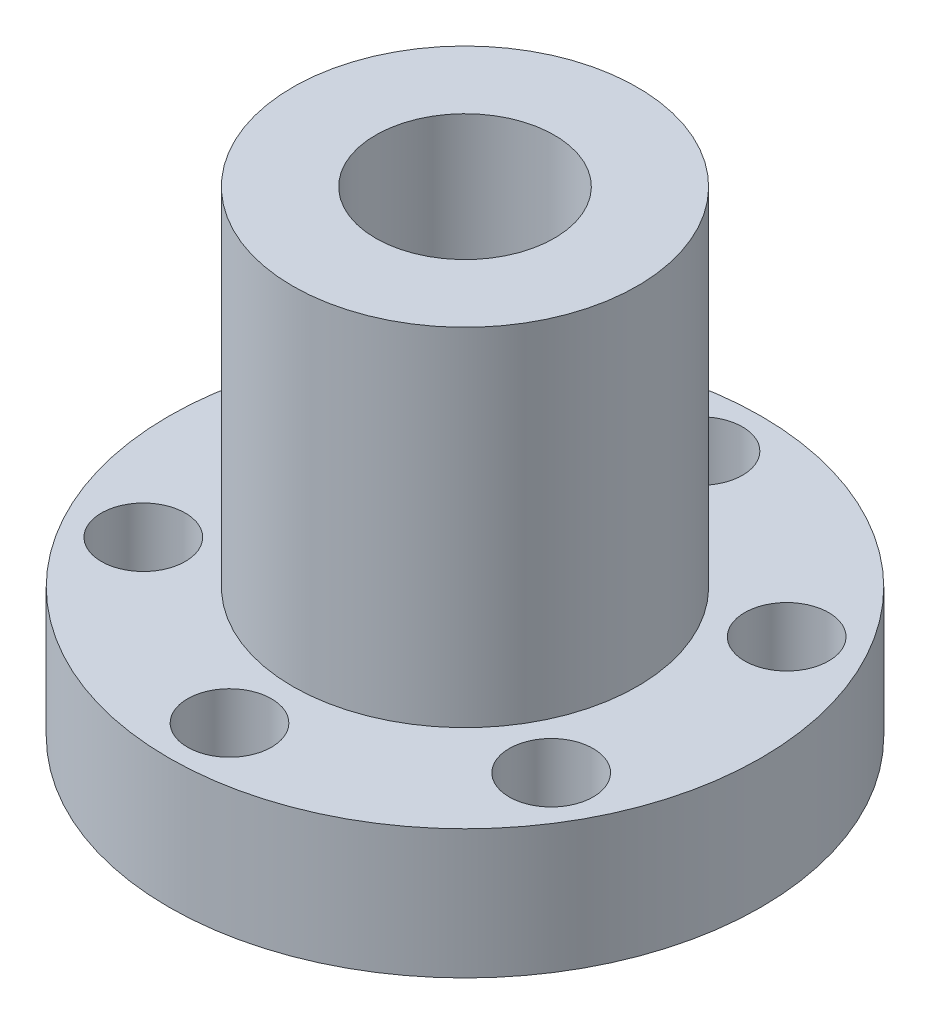
ISO-10303-21;
HEADER;
FILE_DESCRIPTION(('STEP AP214'),'2;1');
FILE_NAME('part.step','',(''),(''),'','','');
FILE_SCHEMA(('AUTOMOTIVE_DESIGN { 1 0 10303 214 1 1 1 1 }'));
ENDSEC;
DATA;
#1=APPLICATION_CONTEXT('core data for automotive mechanical design processes');
#2=APPLICATION_PROTOCOL_DEFINITION('international standard','automotive_design',2000,#1);
#3=PRODUCT_CONTEXT('',#1,'mechanical');
#4=PRODUCT('Part','Part','',(#3));
#5=PRODUCT_RELATED_PRODUCT_CATEGORY('part','',(#4));
#6=PRODUCT_DEFINITION_FORMATION('','',#4);
#7=PRODUCT_DEFINITION_CONTEXT('part definition',#1,'design');
#8=PRODUCT_DEFINITION('design','',#6,#7);
#9=PRODUCT_DEFINITION_SHAPE('','',#8);
#10=(LENGTH_UNIT() NAMED_UNIT(*) SI_UNIT(.MILLI.,.METRE.));
#11=(NAMED_UNIT(*) PLANE_ANGLE_UNIT() SI_UNIT($,.RADIAN.));
#12=(NAMED_UNIT(*) SI_UNIT($,.STERADIAN.) SOLID_ANGLE_UNIT());
#13=UNCERTAINTY_MEASURE_WITH_UNIT(LENGTH_MEASURE(1.E-05),#10,'distance_accuracy_value','');
#14=(GEOMETRIC_REPRESENTATION_CONTEXT(3) GLOBAL_UNCERTAINTY_ASSIGNED_CONTEXT((#13)) GLOBAL_UNIT_ASSIGNED_CONTEXT((#10,
#11,#12)) REPRESENTATION_CONTEXT('',''));
#15=CARTESIAN_POINT('',(0.,0.,0.));
#16=DIRECTION('',(0.,0.,1.));
#17=DIRECTION('',(1.,0.,0.));
#18=AXIS2_PLACEMENT_3D('',#15,#16,#17);
#19=CARTESIAN_POINT('',(0.,12.,0.));
#20=DIRECTION('',(0.,1.,0.));
#21=DIRECTION('',(0.,0.,1.));
#22=AXIS2_PLACEMENT_3D('',#19,#20,#21);
#23=PLANE('',#22);
#24=CARTESIAN_POINT('',(18.9399488772411,12.,10.9349845827129));
#25=DIRECTION('',(0.,1.,0.));
#26=DIRECTION('',(0.,0.,1.));
#27=AXIS2_PLACEMENT_3D('',#24,#25,#26);
#28=CIRCLE('',#27,3.9);
#29=CARTESIAN_POINT('',(18.9399488772411,12.,14.8349845827129));
#30=VERTEX_POINT('',#29);
#31=EDGE_CURVE('E52',#30,#30,#28,.F.);
#32=ORIENTED_EDGE('',*,*,#31,.T.);
#33=EDGE_LOOP('',(#32));
#34=FACE_BOUND('',#33,.T.);
#35=CARTESIAN_POINT('',(18.9399488772411,12.,-10.9349845827129));
#36=DIRECTION('',(0.,1.,0.));
#37=DIRECTION('',(0.,0.,1.));
#38=AXIS2_PLACEMENT_3D('',#35,#36,#37);
#39=CIRCLE('',#38,3.9);
#40=CARTESIAN_POINT('',(18.9399488772411,12.,-7.03498458271292));
#41=VERTEX_POINT('',#40);
#42=EDGE_CURVE('E55',#41,#41,#39,.F.);
#43=ORIENTED_EDGE('',*,*,#42,.T.);
#44=EDGE_LOOP('',(#43));
#45=FACE_BOUND('',#44,.T.);
#46=CARTESIAN_POINT('',(0.,12.,-21.8699691654258));
#47=DIRECTION('',(0.,1.,0.));
#48=DIRECTION('',(0.,0.,1.));
#49=AXIS2_PLACEMENT_3D('',#46,#47,#48);
#50=CIRCLE('',#49,3.9);
#51=CARTESIAN_POINT('',(0.,12.,-17.9699691654258));
#52=VERTEX_POINT('',#51);
#53=EDGE_CURVE('E58',#52,#52,#50,.F.);
#54=ORIENTED_EDGE('',*,*,#53,.T.);
#55=EDGE_LOOP('',(#54));
#56=FACE_BOUND('',#55,.T.);
#57=CARTESIAN_POINT('',(-18.9399488772411,12.,-10.9349845827129));
#58=DIRECTION('',(0.,1.,0.));
#59=DIRECTION('',(0.,0.,1.));
#60=AXIS2_PLACEMENT_3D('',#57,#58,#59);
#61=CIRCLE('',#60,3.9);
#62=CARTESIAN_POINT('',(-18.9399488772411,12.,-7.03498458271291));
#63=VERTEX_POINT('',#62);
#64=EDGE_CURVE('E61',#63,#63,#61,.F.);
#65=ORIENTED_EDGE('',*,*,#64,.T.);
#66=EDGE_LOOP('',(#65));
#67=FACE_BOUND('',#66,.T.);
#68=CARTESIAN_POINT('',(-18.9399488772411,12.,10.9349845827129));
#69=DIRECTION('',(0.,1.,0.));
#70=DIRECTION('',(0.,0.,1.));
#71=AXIS2_PLACEMENT_3D('',#68,#69,#70);
#72=CIRCLE('',#71,3.9);
#73=CARTESIAN_POINT('',(-18.9399488772411,12.,14.8349845827129));
#74=VERTEX_POINT('',#73);
#75=EDGE_CURVE('E64',#74,#74,#72,.F.);
#76=ORIENTED_EDGE('',*,*,#75,.T.);
#77=EDGE_LOOP('',(#76));
#78=FACE_BOUND('',#77,.T.);
#79=CARTESIAN_POINT('',(0.,12.,21.8699691654258));
#80=DIRECTION('',(0.,1.,0.));
#81=DIRECTION('',(0.,0.,1.));
#82=AXIS2_PLACEMENT_3D('',#79,#80,#81);
#83=CIRCLE('',#82,3.9);
#84=CARTESIAN_POINT('',(0.,12.,25.7699691654258));
#85=VERTEX_POINT('',#84);
#86=EDGE_CURVE('E67',#85,#85,#83,.F.);
#87=ORIENTED_EDGE('',*,*,#86,.T.);
#88=EDGE_LOOP('',(#87));
#89=FACE_BOUND('',#88,.T.);
#90=CARTESIAN_POINT('',(0.,12.,0.));
#91=DIRECTION('',(0.,1.,0.));
#92=DIRECTION('',(0.,0.,1.));
#93=AXIS2_PLACEMENT_3D('',#90,#91,#92);
#94=CIRCLE('',#93,27.5);
#95=CARTESIAN_POINT('',(0.,12.,27.5));
#96=VERTEX_POINT('',#95);
#97=EDGE_CURVE('E10',#96,#96,#94,.T.);
#98=ORIENTED_EDGE('',*,*,#97,.T.);
#99=EDGE_LOOP('',(#98));
#100=FACE_BOUND('',#99,.T.);
#101=CARTESIAN_POINT('',(0.,12.,0.));
#102=DIRECTION('',(0.,1.,0.));
#103=DIRECTION('',(0.,0.,1.));
#104=AXIS2_PLACEMENT_3D('',#101,#102,#103);
#105=CIRCLE('',#104,16.);
#106=CARTESIAN_POINT('',(0.,12.,16.));
#107=VERTEX_POINT('',#106);
#108=EDGE_CURVE('E45',#107,#107,#105,.T.);
#109=ORIENTED_EDGE('',*,*,#108,.F.);
#110=EDGE_LOOP('',(#109));
#111=FACE_BOUND('',#110,.T.);
#112=ADVANCED_FACE('F34',(#34,#45,#56,#67,#78,#89,#100,#111),#23,.T.);
#113=CARTESIAN_POINT('',(0.,0.,0.));
#114=DIRECTION('',(0.,1.,0.));
#115=DIRECTION('',(0.,0.,1.));
#116=AXIS2_PLACEMENT_3D('',#113,#114,#115);
#117=PLANE('',#116);
#118=CARTESIAN_POINT('',(18.9399488772411,0.,10.9349845827129));
#119=DIRECTION('',(0.,1.,0.));
#120=DIRECTION('',(0.,0.,1.));
#121=AXIS2_PLACEMENT_3D('',#118,#119,#120);
#122=CIRCLE('',#121,3.9);
#123=CARTESIAN_POINT('',(18.9399488772411,0.,14.8349845827129));
#124=VERTEX_POINT('',#123);
#125=EDGE_CURVE('E77',#124,#124,#122,.T.);
#126=ORIENTED_EDGE('',*,*,#125,.T.);
#127=EDGE_LOOP('',(#126));
#128=FACE_BOUND('',#127,.T.);
#129=CARTESIAN_POINT('',(18.9399488772411,0.,-10.9349845827129));
#130=DIRECTION('',(0.,1.,0.));
#131=DIRECTION('',(0.,0.,1.));
#132=AXIS2_PLACEMENT_3D('',#129,#130,#131);
#133=CIRCLE('',#132,3.9);
#134=CARTESIAN_POINT('',(18.9399488772411,0.,-7.03498458271292));
#135=VERTEX_POINT('',#134);
#136=EDGE_CURVE('E80',#135,#135,#133,.T.);
#137=ORIENTED_EDGE('',*,*,#136,.T.);
#138=EDGE_LOOP('',(#137));
#139=FACE_BOUND('',#138,.T.);
#140=CARTESIAN_POINT('',(0.,0.,-21.8699691654258));
#141=DIRECTION('',(0.,1.,0.));
#142=DIRECTION('',(0.,0.,1.));
#143=AXIS2_PLACEMENT_3D('',#140,#141,#142);
#144=CIRCLE('',#143,3.9);
#145=CARTESIAN_POINT('',(0.,0.,-17.9699691654258));
#146=VERTEX_POINT('',#145);
#147=EDGE_CURVE('E83',#146,#146,#144,.T.);
#148=ORIENTED_EDGE('',*,*,#147,.T.);
#149=EDGE_LOOP('',(#148));
#150=FACE_BOUND('',#149,.T.);
#151=CARTESIAN_POINT('',(-18.9399488772411,0.,-10.9349845827129));
#152=DIRECTION('',(0.,1.,0.));
#153=DIRECTION('',(0.,0.,1.));
#154=AXIS2_PLACEMENT_3D('',#151,#152,#153);
#155=CIRCLE('',#154,3.9);
#156=CARTESIAN_POINT('',(-18.9399488772411,0.,-7.03498458271291));
#157=VERTEX_POINT('',#156);
#158=EDGE_CURVE('E86',#157,#157,#155,.T.);
#159=ORIENTED_EDGE('',*,*,#158,.T.);
#160=EDGE_LOOP('',(#159));
#161=FACE_BOUND('',#160,.T.);
#162=CARTESIAN_POINT('',(-18.9399488772411,0.,10.9349845827129));
#163=DIRECTION('',(0.,1.,0.));
#164=DIRECTION('',(0.,0.,1.));
#165=AXIS2_PLACEMENT_3D('',#162,#163,#164);
#166=CIRCLE('',#165,3.9);
#167=CARTESIAN_POINT('',(-18.9399488772411,0.,14.8349845827129));
#168=VERTEX_POINT('',#167);
#169=EDGE_CURVE('E89',#168,#168,#166,.T.);
#170=ORIENTED_EDGE('',*,*,#169,.T.);
#171=EDGE_LOOP('',(#170));
#172=FACE_BOUND('',#171,.T.);
#173=CARTESIAN_POINT('',(0.,0.,21.8699691654258));
#174=DIRECTION('',(0.,1.,0.));
#175=DIRECTION('',(0.,0.,1.));
#176=AXIS2_PLACEMENT_3D('',#173,#174,#175);
#177=CIRCLE('',#176,3.9);
#178=CARTESIAN_POINT('',(0.,0.,25.7699691654258));
#179=VERTEX_POINT('',#178);
#180=EDGE_CURVE('E74',#179,#179,#177,.T.);
#181=ORIENTED_EDGE('',*,*,#180,.T.);
#182=EDGE_LOOP('',(#181));
#183=FACE_BOUND('',#182,.T.);
#184=CARTESIAN_POINT('',(0.,0.,0.));
#185=DIRECTION('',(0.,1.,0.));
#186=DIRECTION('',(0.,0.,1.));
#187=AXIS2_PLACEMENT_3D('',#184,#185,#186);
#188=CIRCLE('',#187,8.3);
#189=CARTESIAN_POINT('',(0.,0.,8.3));
#190=VERTEX_POINT('',#189);
#191=EDGE_CURVE('E71',#190,#190,#188,.T.);
#192=ORIENTED_EDGE('',*,*,#191,.T.);
#193=EDGE_LOOP('',(#192));
#194=FACE_BOUND('',#193,.T.);
#195=CARTESIAN_POINT('',(0.,0.,0.));
#196=DIRECTION('',(0.,1.,0.));
#197=DIRECTION('',(0.,0.,1.));
#198=AXIS2_PLACEMENT_3D('',#195,#196,#197);
#199=CIRCLE('',#198,27.5);
#200=CARTESIAN_POINT('',(0.,0.,27.5));
#201=VERTEX_POINT('',#200);
#202=EDGE_CURVE('E38',#201,#201,#199,.T.);
#203=ORIENTED_EDGE('',*,*,#202,.F.);
#204=EDGE_LOOP('',(#203));
#205=FACE_BOUND('',#204,.T.);
#206=ADVANCED_FACE('F95',(#128,#139,#150,#161,#172,#183,#194,#205),#117,.F.);
#207=CARTESIAN_POINT('',(0.,12.,0.));
#208=DIRECTION('',(0.,-1.,0.));
#209=DIRECTION('',(0.,0.,-1.));
#210=AXIS2_PLACEMENT_3D('',#207,#208,#209);
#211=CYLINDRICAL_SURFACE('',#210,27.5);
#212=ORIENTED_EDGE('',*,*,#97,.F.);
#213=EDGE_LOOP('',(#212));
#214=FACE_BOUND('',#213,.T.);
#215=ORIENTED_EDGE('',*,*,#202,.T.);
#216=EDGE_LOOP('',(#215));
#217=FACE_BOUND('',#216,.T.);
#218=ADVANCED_FACE('F36',(#214,#217),#211,.T.);
#219=CARTESIAN_POINT('',(0.,44.2,0.));
#220=DIRECTION('',(0.,-1.,0.));
#221=DIRECTION('',(0.,0.,-1.));
#222=AXIS2_PLACEMENT_3D('',#219,#220,#221);
#223=CYLINDRICAL_SURFACE('',#222,16.);
#224=ORIENTED_EDGE('',*,*,#108,.T.);
#225=EDGE_LOOP('',(#224));
#226=FACE_BOUND('',#225,.T.);
#227=CARTESIAN_POINT('',(0.,44.2,0.));
#228=DIRECTION('',(0.,1.,0.));
#229=DIRECTION('',(0.,0.,1.));
#230=AXIS2_PLACEMENT_3D('',#227,#228,#229);
#231=CIRCLE('',#230,16.);
#232=CARTESIAN_POINT('',(0.,44.2,16.));
#233=VERTEX_POINT('',#232);
#234=EDGE_CURVE('E49',#233,#233,#231,.T.);
#235=ORIENTED_EDGE('',*,*,#234,.F.);
#236=EDGE_LOOP('',(#235));
#237=FACE_BOUND('',#236,.T.);
#238=ADVANCED_FACE('F124',(#226,#237),#223,.T.);
#239=CARTESIAN_POINT('',(0.,44.2,0.));
#240=DIRECTION('',(0.,1.,0.));
#241=DIRECTION('',(0.,0.,1.));
#242=AXIS2_PLACEMENT_3D('',#239,#240,#241);
#243=PLANE('',#242);
#244=CARTESIAN_POINT('',(0.,44.2,0.));
#245=DIRECTION('',(0.,1.,0.));
#246=DIRECTION('',(0.,0.,1.));
#247=AXIS2_PLACEMENT_3D('',#244,#245,#246);
#248=CIRCLE('',#247,8.3);
#249=CARTESIAN_POINT('',(0.,44.2,8.3));
#250=VERTEX_POINT('',#249);
#251=EDGE_CURVE('E70',#250,#250,#248,.T.);
#252=ORIENTED_EDGE('',*,*,#251,.F.);
#253=EDGE_LOOP('',(#252));
#254=FACE_BOUND('',#253,.T.);
#255=ORIENTED_EDGE('',*,*,#234,.T.);
#256=EDGE_LOOP('',(#255));
#257=FACE_BOUND('',#256,.T.);
#258=ADVANCED_FACE('F111',(#254,#257),#243,.T.);
#259=CARTESIAN_POINT('',(0.,44.2,0.));
#260=DIRECTION('',(0.,-1.,0.));
#261=DIRECTION('',(0.,0.,-1.));
#262=AXIS2_PLACEMENT_3D('',#259,#260,#261);
#263=CYLINDRICAL_SURFACE('',#262,8.3);
#264=ORIENTED_EDGE('',*,*,#251,.T.);
#265=EDGE_LOOP('',(#264));
#266=FACE_BOUND('',#265,.T.);
#267=ORIENTED_EDGE('',*,*,#191,.F.);
#268=EDGE_LOOP('',(#267));
#269=FACE_BOUND('',#268,.T.);
#270=ADVANCED_FACE('F101',(#266,#269),#263,.F.);
#271=CARTESIAN_POINT('',(0.,44.2,21.8699691654258));
#272=DIRECTION('',(0.,-1.,0.));
#273=DIRECTION('',(0.,0.,-1.));
#274=AXIS2_PLACEMENT_3D('',#271,#272,#273);
#275=CYLINDRICAL_SURFACE('',#274,3.9);
#276=ORIENTED_EDGE('',*,*,#86,.F.);
#277=EDGE_LOOP('',(#276));
#278=FACE_BOUND('',#277,.T.);
#279=ORIENTED_EDGE('',*,*,#180,.F.);
#280=EDGE_LOOP('',(#279));
#281=FACE_BOUND('',#280,.T.);
#282=ADVANCED_FACE('F98',(#278,#281),#275,.F.);
#283=CARTESIAN_POINT('',(-18.9399488772411,44.2,10.9349845827129));
#284=DIRECTION('',(0.,-1.,0.));
#285=DIRECTION('',(0.,0.,-1.));
#286=AXIS2_PLACEMENT_3D('',#283,#284,#285);
#287=CYLINDRICAL_SURFACE('',#286,3.9);
#288=ORIENTED_EDGE('',*,*,#75,.F.);
#289=EDGE_LOOP('',(#288));
#290=FACE_BOUND('',#289,.T.);
#291=ORIENTED_EDGE('',*,*,#169,.F.);
#292=EDGE_LOOP('',(#291));
#293=FACE_BOUND('',#292,.T.);
#294=ADVANCED_FACE('F100',(#290,#293),#287,.F.);
#295=CARTESIAN_POINT('',(-18.9399488772411,44.2,-10.9349845827129));
#296=DIRECTION('',(0.,-1.,0.));
#297=DIRECTION('',(0.,0.,-1.));
#298=AXIS2_PLACEMENT_3D('',#295,#296,#297);
#299=CYLINDRICAL_SURFACE('',#298,3.9);
#300=ORIENTED_EDGE('',*,*,#64,.F.);
#301=EDGE_LOOP('',(#300));
#302=FACE_BOUND('',#301,.T.);
#303=ORIENTED_EDGE('',*,*,#158,.F.);
#304=EDGE_LOOP('',(#303));
#305=FACE_BOUND('',#304,.T.);
#306=ADVANCED_FACE('F108',(#302,#305),#299,.F.);
#307=CARTESIAN_POINT('',(0.,44.2,-21.8699691654258));
#308=DIRECTION('',(0.,-1.,0.));
#309=DIRECTION('',(0.,0.,-1.));
#310=AXIS2_PLACEMENT_3D('',#307,#308,#309);
#311=CYLINDRICAL_SURFACE('',#310,3.9);
#312=ORIENTED_EDGE('',*,*,#53,.F.);
#313=EDGE_LOOP('',(#312));
#314=FACE_BOUND('',#313,.T.);
#315=ORIENTED_EDGE('',*,*,#147,.F.);
#316=EDGE_LOOP('',(#315));
#317=FACE_BOUND('',#316,.T.);
#318=ADVANCED_FACE('F138',(#314,#317),#311,.F.);
#319=CARTESIAN_POINT('',(18.9399488772411,44.2,-10.9349845827129));
#320=DIRECTION('',(0.,-1.,0.));
#321=DIRECTION('',(0.,0.,-1.));
#322=AXIS2_PLACEMENT_3D('',#319,#320,#321);
#323=CYLINDRICAL_SURFACE('',#322,3.9);
#324=ORIENTED_EDGE('',*,*,#42,.F.);
#325=EDGE_LOOP('',(#324));
#326=FACE_BOUND('',#325,.T.);
#327=ORIENTED_EDGE('',*,*,#136,.F.);
#328=EDGE_LOOP('',(#327));
#329=FACE_BOUND('',#328,.T.);
#330=ADVANCED_FACE('F134',(#326,#329),#323,.F.);
#331=CARTESIAN_POINT('',(18.9399488772411,44.2,10.9349845827129));
#332=DIRECTION('',(0.,-1.,0.));
#333=DIRECTION('',(0.,0.,-1.));
#334=AXIS2_PLACEMENT_3D('',#331,#332,#333);
#335=CYLINDRICAL_SURFACE('',#334,3.9);
#336=ORIENTED_EDGE('',*,*,#31,.F.);
#337=EDGE_LOOP('',(#336));
#338=FACE_BOUND('',#337,.T.);
#339=ORIENTED_EDGE('',*,*,#125,.F.);
#340=EDGE_LOOP('',(#339));
#341=FACE_BOUND('',#340,.T.);
#342=ADVANCED_FACE('F131',(#338,#341),#335,.F.);
#343=CLOSED_SHELL('',(#112,#206,#218,#238,#258,#270,#282,#294,#306,#318,#330,#342));
#344=MANIFOLD_SOLID_BREP('B2',#343);
#345=ADVANCED_BREP_SHAPE_REPRESENTATION('',(#18,#344),#14);
#346=SHAPE_DEFINITION_REPRESENTATION(#9,#345);
ENDSEC;
END-ISO-10303-21;
